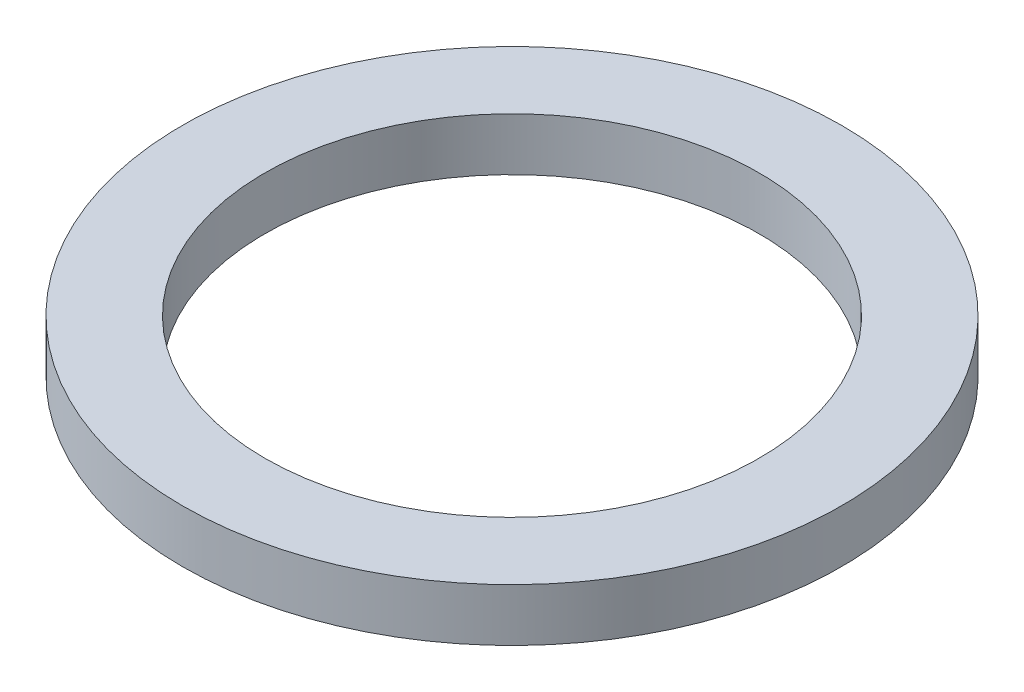
ISO-10303-21;
HEADER;
FILE_DESCRIPTION(('STEP AP214'),'2;1');
FILE_NAME('part.step','',(''),(''),'','','');
FILE_SCHEMA(('AUTOMOTIVE_DESIGN { 1 0 10303 214 1 1 1 1 }'));
ENDSEC;
DATA;
#1=APPLICATION_CONTEXT('core data for automotive mechanical design processes');
#2=APPLICATION_PROTOCOL_DEFINITION('international standard','automotive_design',2000,#1);
#3=PRODUCT_CONTEXT('',#1,'mechanical');
#4=PRODUCT('Part','Part','',(#3));
#5=PRODUCT_RELATED_PRODUCT_CATEGORY('part','',(#4));
#6=PRODUCT_DEFINITION_FORMATION('','',#4);
#7=PRODUCT_DEFINITION_CONTEXT('part definition',#1,'design');
#8=PRODUCT_DEFINITION('design','',#6,#7);
#9=PRODUCT_DEFINITION_SHAPE('','',#8);
#10=(LENGTH_UNIT() NAMED_UNIT(*) SI_UNIT(.MILLI.,.METRE.));
#11=(NAMED_UNIT(*) PLANE_ANGLE_UNIT() SI_UNIT($,.RADIAN.));
#12=(NAMED_UNIT(*) SI_UNIT($,.STERADIAN.) SOLID_ANGLE_UNIT());
#13=UNCERTAINTY_MEASURE_WITH_UNIT(LENGTH_MEASURE(1.E-05),#10,'distance_accuracy_value','');
#14=(GEOMETRIC_REPRESENTATION_CONTEXT(3) GLOBAL_UNCERTAINTY_ASSIGNED_CONTEXT((#13)) GLOBAL_UNIT_ASSIGNED_CONTEXT((#10,
#11,#12)) REPRESENTATION_CONTEXT('',''));
#15=CARTESIAN_POINT('',(0.,0.,0.));
#16=DIRECTION('',(0.,0.,1.));
#17=DIRECTION('',(1.,0.,0.));
#18=AXIS2_PLACEMENT_3D('',#15,#16,#17);
#19=CARTESIAN_POINT('',(0.,8.,0.));
#20=DIRECTION('',(0.,-1.,0.));
#21=DIRECTION('',(0.,0.,-1.));
#22=AXIS2_PLACEMENT_3D('',#19,#20,#21);
#23=CYLINDRICAL_SURFACE('',#22,50.);
#24=CARTESIAN_POINT('',(0.,8.,0.));
#25=DIRECTION('',(0.,1.,0.));
#26=DIRECTION('',(0.,0.,1.));
#27=AXIS2_PLACEMENT_3D('',#24,#25,#26);
#28=CIRCLE('',#27,50.);
#29=CARTESIAN_POINT('',(0.,8.,50.));
#30=VERTEX_POINT('',#29);
#31=EDGE_CURVE('E10',#30,#30,#28,.T.);
#32=ORIENTED_EDGE('',*,*,#31,.F.);
#33=EDGE_LOOP('',(#32));
#34=FACE_BOUND('',#33,.T.);
#35=CARTESIAN_POINT('',(0.,0.,0.));
#36=DIRECTION('',(0.,1.,0.));
#37=DIRECTION('',(0.,0.,1.));
#38=AXIS2_PLACEMENT_3D('',#35,#36,#37);
#39=CIRCLE('',#38,50.);
#40=CARTESIAN_POINT('',(0.,0.,50.));
#41=VERTEX_POINT('',#40);
#42=EDGE_CURVE('E37',#41,#41,#39,.T.);
#43=ORIENTED_EDGE('',*,*,#42,.T.);
#44=EDGE_LOOP('',(#43));
#45=FACE_BOUND('',#44,.T.);
#46=ADVANCED_FACE('F40',(#34,#45),#23,.T.);
#47=CARTESIAN_POINT('',(0.,8.,0.));
#48=DIRECTION('',(0.,1.,0.));
#49=DIRECTION('',(0.,0.,1.));
#50=AXIS2_PLACEMENT_3D('',#47,#48,#49);
#51=PLANE('',#50);
#52=CARTESIAN_POINT('',(0.,8.,0.));
#53=DIRECTION('',(0.,1.,0.));
#54=DIRECTION('',(0.,0.,1.));
#55=AXIS2_PLACEMENT_3D('',#52,#53,#54);
#56=CIRCLE('',#55,37.5);
#57=CARTESIAN_POINT('',(0.,8.,37.5));
#58=VERTEX_POINT('',#57);
#59=EDGE_CURVE('E50',#58,#58,#56,.T.);
#60=ORIENTED_EDGE('',*,*,#59,.F.);
#61=EDGE_LOOP('',(#60));
#62=FACE_BOUND('',#61,.T.);
#63=ORIENTED_EDGE('',*,*,#31,.T.);
#64=EDGE_LOOP('',(#63));
#65=FACE_BOUND('',#64,.T.);
#66=ADVANCED_FACE('F59',(#62,#65),#51,.T.);
#67=CARTESIAN_POINT('',(0.,0.,0.));
#68=DIRECTION('',(0.,1.,0.));
#69=DIRECTION('',(0.,0.,1.));
#70=AXIS2_PLACEMENT_3D('',#67,#68,#69);
#71=PLANE('',#70);
#72=CARTESIAN_POINT('',(0.,0.,0.));
#73=DIRECTION('',(0.,1.,0.));
#74=DIRECTION('',(0.,0.,1.));
#75=AXIS2_PLACEMENT_3D('',#72,#73,#74);
#76=CIRCLE('',#75,37.5);
#77=CARTESIAN_POINT('',(0.,0.,37.5));
#78=VERTEX_POINT('',#77);
#79=EDGE_CURVE('E47',#78,#78,#76,.T.);
#80=ORIENTED_EDGE('',*,*,#79,.T.);
#81=EDGE_LOOP('',(#80));
#82=FACE_BOUND('',#81,.T.);
#83=ORIENTED_EDGE('',*,*,#42,.F.);
#84=EDGE_LOOP('',(#83));
#85=FACE_BOUND('',#84,.T.);
#86=ADVANCED_FACE('F58',(#82,#85),#71,.F.);
#87=CARTESIAN_POINT('',(0.,8.,0.));
#88=DIRECTION('',(0.,-1.,0.));
#89=DIRECTION('',(0.,0.,-1.));
#90=AXIS2_PLACEMENT_3D('',#87,#88,#89);
#91=CYLINDRICAL_SURFACE('',#90,37.5);
#92=ORIENTED_EDGE('',*,*,#59,.T.);
#93=EDGE_LOOP('',(#92));
#94=FACE_BOUND('',#93,.T.);
#95=ORIENTED_EDGE('',*,*,#79,.F.);
#96=EDGE_LOOP('',(#95));
#97=FACE_BOUND('',#96,.T.);
#98=ADVANCED_FACE('F54',(#94,#97),#91,.F.);
#99=CLOSED_SHELL('',(#46,#66,#86,#98));
#100=MANIFOLD_SOLID_BREP('B2',#99);
#101=ADVANCED_BREP_SHAPE_REPRESENTATION('',(#18,#100),#14);
#102=SHAPE_DEFINITION_REPRESENTATION(#9,#101);
ENDSEC;
END-ISO-10303-21;
